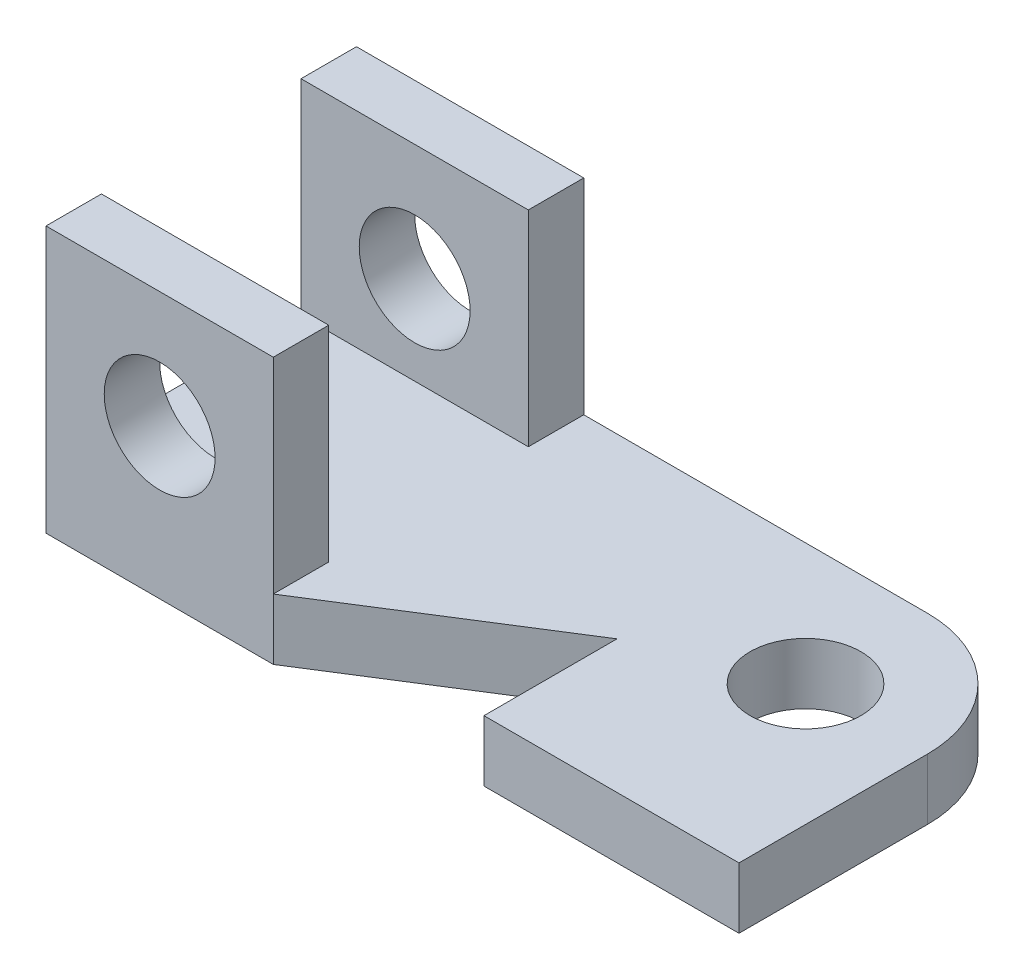
ISO-10303-21;
HEADER;
FILE_DESCRIPTION(('STEP AP214'),'2;1');
FILE_NAME('part.step','',(''),(''),'','','');
FILE_SCHEMA(('AUTOMOTIVE_DESIGN { 1 0 10303 214 1 1 1 1 }'));
ENDSEC;
DATA;
#1=APPLICATION_CONTEXT('core data for automotive mechanical design processes');
#2=APPLICATION_PROTOCOL_DEFINITION('international standard','automotive_design',2000,#1);
#3=PRODUCT_CONTEXT('',#1,'mechanical');
#4=PRODUCT('Part','Part','',(#3));
#5=PRODUCT_RELATED_PRODUCT_CATEGORY('part','',(#4));
#6=PRODUCT_DEFINITION_FORMATION('','',#4);
#7=PRODUCT_DEFINITION_CONTEXT('part definition',#1,'design');
#8=PRODUCT_DEFINITION('design','',#6,#7);
#9=PRODUCT_DEFINITION_SHAPE('','',#8);
#10=(LENGTH_UNIT() NAMED_UNIT(*) SI_UNIT(.MILLI.,.METRE.));
#11=(NAMED_UNIT(*) PLANE_ANGLE_UNIT() SI_UNIT($,.RADIAN.));
#12=(NAMED_UNIT(*) SI_UNIT($,.STERADIAN.) SOLID_ANGLE_UNIT());
#13=UNCERTAINTY_MEASURE_WITH_UNIT(LENGTH_MEASURE(1.E-05),#10,'distance_accuracy_value','');
#14=(GEOMETRIC_REPRESENTATION_CONTEXT(3) GLOBAL_UNCERTAINTY_ASSIGNED_CONTEXT((#13)) GLOBAL_UNIT_ASSIGNED_CONTEXT((#10,
#11,#12)) REPRESENTATION_CONTEXT('',''));
#15=CARTESIAN_POINT('',(0.,0.,0.));
#16=DIRECTION('',(0.,0.,1.));
#17=DIRECTION('',(1.,0.,0.));
#18=AXIS2_PLACEMENT_3D('',#15,#16,#17);
#19=CARTESIAN_POINT('',(-22.,11.,-34.));
#20=DIRECTION('',(0.,1.,0.));
#21=DIRECTION('',(0.,0.,1.));
#22=AXIS2_PLACEMENT_3D('',#19,#20,#21);
#23=PLANE('',#22);
#24=DIRECTION('',(0.,0.,-1.));
#25=VECTOR('',#24,1.);
#26=CARTESIAN_POINT('',(-84.,11.,-56.));
#27=LINE('',#26,#25);
#28=CARTESIAN_POINT('',(-84.,11.,-46.));
#29=VERTEX_POINT('',#28);
#30=CARTESIAN_POINT('',(-84.,11.,-56.));
#31=VERTEX_POINT('',#30);
#32=EDGE_CURVE('E155',#29,#31,#27,.T.);
#33=ORIENTED_EDGE('',*,*,#32,.F.);
#34=DIRECTION('',(1.,0.,0.));
#35=VECTOR('',#34,1.);
#36=CARTESIAN_POINT('',(-125.,11.,-46.));
#37=LINE('',#36,#35);
#38=CARTESIAN_POINT('',(-125.,11.,-46.));
#39=VERTEX_POINT('',#38);
#40=EDGE_CURVE('E60',#39,#29,#37,.T.);
#41=ORIENTED_EDGE('',*,*,#40,.F.);
#42=DIRECTION('',(0.,0.,1.));
#43=VECTOR('',#42,1.);
#44=CARTESIAN_POINT('',(-125.,11.,0.));
#45=LINE('',#44,#43);
#46=CARTESIAN_POINT('',(-125.,11.,-10.));
#47=VERTEX_POINT('',#46);
#48=EDGE_CURVE('E55',#39,#47,#45,.T.);
#49=ORIENTED_EDGE('',*,*,#48,.T.);
#50=DIRECTION('',(-1.,0.,0.));
#51=VECTOR('',#50,1.);
#52=CARTESIAN_POINT('',(-125.,11.,-10.));
#53=LINE('',#52,#51);
#54=CARTESIAN_POINT('',(-84.,11.,-10.));
#55=VERTEX_POINT('',#54);
#56=EDGE_CURVE('E178',#55,#47,#53,.T.);
#57=ORIENTED_EDGE('',*,*,#56,.F.);
#58=DIRECTION('',(0.,0.,-1.));
#59=VECTOR('',#58,1.);
#60=CARTESIAN_POINT('',(-84.,11.,0.));
#61=LINE('',#60,#59);
#62=CARTESIAN_POINT('',(-84.,11.,0.));
#63=VERTEX_POINT('',#62);
#64=EDGE_CURVE('E180',#63,#55,#61,.T.);
#65=ORIENTED_EDGE('',*,*,#64,.F.);
#66=DIRECTION('',(0.845488903030971,0.,-0.533992991387982));
#67=VECTOR('',#66,1.);
#68=CARTESIAN_POINT('',(-84.,11.,0.));
#69=LINE('',#68,#67);
#70=CARTESIAN_POINT('',(-46.,11.,-24.));
#71=VERTEX_POINT('',#70);
#72=EDGE_CURVE('E203',#63,#71,#69,.T.);
#73=ORIENTED_EDGE('',*,*,#72,.T.);
#74=DIRECTION('',(0.,0.,1.));
#75=VECTOR('',#74,1.);
#76=CARTESIAN_POINT('',(-46.,11.,0.));
#77=LINE('',#76,#75);
#78=CARTESIAN_POINT('',(-46.,11.,0.));
#79=VERTEX_POINT('',#78);
#80=EDGE_CURVE('E205',#71,#79,#77,.T.);
#81=ORIENTED_EDGE('',*,*,#80,.T.);
#82=DIRECTION('',(1.,0.,0.));
#83=VECTOR('',#82,1.);
#84=CARTESIAN_POINT('',(0.,11.,0.));
#85=LINE('',#84,#83);
#86=CARTESIAN_POINT('',(0.,11.,0.));
#87=VERTEX_POINT('',#86);
#88=EDGE_CURVE('E207',#79,#87,#85,.T.);
#89=ORIENTED_EDGE('',*,*,#88,.T.);
#90=DIRECTION('',(0.,0.,-1.));
#91=VECTOR('',#90,1.);
#92=CARTESIAN_POINT('',(0.,11.,0.));
#93=LINE('',#92,#91);
#94=CARTESIAN_POINT('',(0.,11.,-33.9999999999999));
#95=VERTEX_POINT('',#94);
#96=EDGE_CURVE('E194',#87,#95,#93,.T.);
#97=ORIENTED_EDGE('',*,*,#96,.T.);
#98=CARTESIAN_POINT('',(-22.,11.,-34.));
#99=DIRECTION('',(0.,1.,0.));
#100=DIRECTION('',(0.,0.,1.));
#101=AXIS2_PLACEMENT_3D('',#98,#99,#100);
#102=CIRCLE('',#101,22.);
#103=CARTESIAN_POINT('',(-22.0000000000002,11.,-56.));
#104=VERTEX_POINT('',#103);
#105=EDGE_CURVE('E197',#95,#104,#102,.T.);
#106=ORIENTED_EDGE('',*,*,#105,.T.);
#107=DIRECTION('',(-1.,0.,0.));
#108=VECTOR('',#107,1.);
#109=CARTESIAN_POINT('',(-22.0000000000002,11.,-56.));
#110=LINE('',#109,#108);
#111=EDGE_CURVE('E200',#104,#31,#110,.T.);
#112=ORIENTED_EDGE('',*,*,#111,.T.);
#113=EDGE_LOOP('',(#33,#41,#49,#57,#65,#73,#81,#89,#97,#106,#112));
#114=FACE_BOUND('',#113,.T.);
#115=CARTESIAN_POINT('',(-22.,11.,-34.));
#116=DIRECTION('',(0.,1.,0.));
#117=DIRECTION('',(0.,0.,1.));
#118=AXIS2_PLACEMENT_3D('',#115,#116,#117);
#119=CIRCLE('',#118,10.);
#120=CARTESIAN_POINT('',(-22.,11.,-24.));
#121=VERTEX_POINT('',#120);
#122=EDGE_CURVE('E162',#121,#121,#119,.T.);
#123=ORIENTED_EDGE('',*,*,#122,.F.);
#124=EDGE_LOOP('',(#123));
#125=FACE_BOUND('',#124,.T.);
#126=ADVANCED_FACE('F39',(#114,#125),#23,.T.);
#127=CARTESIAN_POINT('',(-22.,0.,-34.));
#128=DIRECTION('',(0.,1.,0.));
#129=DIRECTION('',(0.,0.,1.));
#130=AXIS2_PLACEMENT_3D('',#127,#128,#129);
#131=PLANE('',#130);
#132=DIRECTION('',(0.,0.,-1.));
#133=VECTOR('',#132,1.);
#134=CARTESIAN_POINT('',(0.,0.,0.));
#135=LINE('',#134,#133);
#136=CARTESIAN_POINT('',(0.,0.,0.));
#137=VERTEX_POINT('',#136);
#138=CARTESIAN_POINT('',(0.,0.,-33.9999999999999));
#139=VERTEX_POINT('',#138);
#140=EDGE_CURVE('E192',#137,#139,#135,.T.);
#141=ORIENTED_EDGE('',*,*,#140,.F.);
#142=DIRECTION('',(1.,0.,0.));
#143=VECTOR('',#142,1.);
#144=CARTESIAN_POINT('',(0.,0.,0.));
#145=LINE('',#144,#143);
#146=CARTESIAN_POINT('',(-46.,0.,0.));
#147=VERTEX_POINT('',#146);
#148=EDGE_CURVE('E198',#147,#137,#145,.T.);
#149=ORIENTED_EDGE('',*,*,#148,.F.);
#150=DIRECTION('',(0.,0.,1.));
#151=VECTOR('',#150,1.);
#152=CARTESIAN_POINT('',(-46.,0.,0.));
#153=LINE('',#152,#151);
#154=CARTESIAN_POINT('',(-46.,0.,-24.));
#155=VERTEX_POINT('',#154);
#156=EDGE_CURVE('E222',#155,#147,#153,.T.);
#157=ORIENTED_EDGE('',*,*,#156,.F.);
#158=DIRECTION('',(0.845488903030971,0.,-0.533992991387982));
#159=VECTOR('',#158,1.);
#160=CARTESIAN_POINT('',(-84.,0.,0.));
#161=LINE('',#160,#159);
#162=CARTESIAN_POINT('',(-84.,0.,0.));
#163=VERTEX_POINT('',#162);
#164=EDGE_CURVE('E220',#163,#155,#161,.T.);
#165=ORIENTED_EDGE('',*,*,#164,.F.);
#166=DIRECTION('',(1.,0.,0.));
#167=VECTOR('',#166,1.);
#168=CARTESIAN_POINT('',(-84.,0.,0.));
#169=LINE('',#168,#167);
#170=CARTESIAN_POINT('',(-125.,0.,0.));
#171=VERTEX_POINT('',#170);
#172=EDGE_CURVE('E218',#171,#163,#169,.T.);
#173=ORIENTED_EDGE('',*,*,#172,.F.);
#174=DIRECTION('',(0.,0.,1.));
#175=VECTOR('',#174,1.);
#176=CARTESIAN_POINT('',(-125.,0.,0.));
#177=LINE('',#176,#175);
#178=CARTESIAN_POINT('',(-125.,0.,-56.));
#179=VERTEX_POINT('',#178);
#180=EDGE_CURVE('E216',#179,#171,#177,.T.);
#181=ORIENTED_EDGE('',*,*,#180,.F.);
#182=DIRECTION('',(-1.,0.,0.));
#183=VECTOR('',#182,1.);
#184=CARTESIAN_POINT('',(-22.0000000000002,0.,-56.));
#185=LINE('',#184,#183);
#186=CARTESIAN_POINT('',(-22.0000000000002,0.,-56.));
#187=VERTEX_POINT('',#186);
#188=EDGE_CURVE('E214',#187,#179,#185,.T.);
#189=ORIENTED_EDGE('',*,*,#188,.F.);
#190=CARTESIAN_POINT('',(-22.,0.,-34.));
#191=DIRECTION('',(0.,1.,0.));
#192=DIRECTION('',(0.,0.,1.));
#193=AXIS2_PLACEMENT_3D('',#190,#191,#192);
#194=CIRCLE('',#193,22.);
#195=EDGE_CURVE('E212',#139,#187,#194,.T.);
#196=ORIENTED_EDGE('',*,*,#195,.F.);
#197=EDGE_LOOP('',(#141,#149,#157,#165,#173,#181,#189,#196));
#198=FACE_BOUND('',#197,.T.);
#199=CARTESIAN_POINT('',(-22.,0.,-34.));
#200=DIRECTION('',(0.,1.,0.));
#201=DIRECTION('',(0.,0.,1.));
#202=AXIS2_PLACEMENT_3D('',#199,#200,#201);
#203=CIRCLE('',#202,10.);
#204=CARTESIAN_POINT('',(-22.,0.,-24.));
#205=VERTEX_POINT('',#204);
#206=EDGE_CURVE('E159',#205,#205,#203,.T.);
#207=ORIENTED_EDGE('',*,*,#206,.T.);
#208=EDGE_LOOP('',(#207));
#209=FACE_BOUND('',#208,.T.);
#210=ADVANCED_FACE('F252',(#198,#209),#131,.F.);
#211=CARTESIAN_POINT('',(0.,11.,0.));
#212=DIRECTION('',(-1.,0.,0.));
#213=DIRECTION('',(0.,0.,1.));
#214=AXIS2_PLACEMENT_3D('',#211,#212,#213);
#215=PLANE('',#214);
#216=ORIENTED_EDGE('',*,*,#140,.T.);
#217=DIRECTION('',(0.,-1.,0.));
#218=VECTOR('',#217,1.);
#219=CARTESIAN_POINT('',(0.,11.,-33.9999999999999));
#220=LINE('',#219,#218);
#221=EDGE_CURVE('E11',#95,#139,#220,.T.);
#222=ORIENTED_EDGE('',*,*,#221,.F.);
#223=ORIENTED_EDGE('',*,*,#96,.F.);
#224=DIRECTION('',(0.,-1.,0.));
#225=VECTOR('',#224,1.);
#226=CARTESIAN_POINT('',(0.,11.,0.));
#227=LINE('',#226,#225);
#228=EDGE_CURVE('E209',#87,#137,#227,.T.);
#229=ORIENTED_EDGE('',*,*,#228,.T.);
#230=EDGE_LOOP('',(#216,#222,#223,#229));
#231=FACE_BOUND('',#230,.T.);
#232=ADVANCED_FACE('F41',(#231),#215,.F.);
#233=CARTESIAN_POINT('',(-22.,11.,-34.));
#234=DIRECTION('',(0.,-1.,0.));
#235=DIRECTION('',(0.,0.,-1.));
#236=AXIS2_PLACEMENT_3D('',#233,#234,#235);
#237=CYLINDRICAL_SURFACE('',#236,22.);
#238=ORIENTED_EDGE('',*,*,#195,.T.);
#239=DIRECTION('',(0.,-1.,0.));
#240=VECTOR('',#239,1.);
#241=CARTESIAN_POINT('',(-22.0000000000002,11.,-56.));
#242=LINE('',#241,#240);
#243=EDGE_CURVE('E48',#104,#187,#242,.T.);
#244=ORIENTED_EDGE('',*,*,#243,.F.);
#245=ORIENTED_EDGE('',*,*,#105,.F.);
#246=ORIENTED_EDGE('',*,*,#221,.T.);
#247=EDGE_LOOP('',(#238,#244,#245,#246));
#248=FACE_BOUND('',#247,.T.);
#249=ADVANCED_FACE('F312',(#248),#237,.T.);
#250=CARTESIAN_POINT('',(-22.0000000000002,11.,-56.));
#251=DIRECTION('',(0.,0.,1.));
#252=DIRECTION('',(1.,0.,0.));
#253=AXIS2_PLACEMENT_3D('',#250,#251,#252);
#254=PLANE('',#253);
#255=CARTESIAN_POINT('',(-104.5,27.,-56.));
#256=DIRECTION('',(0.,0.,1.));
#257=DIRECTION('',(1.,0.,0.));
#258=AXIS2_PLACEMENT_3D('',#255,#256,#257);
#259=CIRCLE('',#258,9.99999999999999);
#260=CARTESIAN_POINT('',(-94.5,27.,-56.));
#261=VERTEX_POINT('',#260);
#262=EDGE_CURVE('E343',#261,#261,#259,.T.);
#263=ORIENTED_EDGE('',*,*,#262,.T.);
#264=EDGE_LOOP('',(#263));
#265=FACE_BOUND('',#264,.T.);
#266=ORIENTED_EDGE('',*,*,#188,.T.);
#267=DIRECTION('',(0.,-1.,0.));
#268=VECTOR('',#267,1.);
#269=CARTESIAN_POINT('',(-125.,11.,-56.));
#270=LINE('',#269,#268);
#271=CARTESIAN_POINT('',(-125.,48.,-56.));
#272=VERTEX_POINT('',#271);
#273=EDGE_CURVE('E239',#272,#179,#270,.T.);
#274=ORIENTED_EDGE('',*,*,#273,.F.);
#275=DIRECTION('',(-1.,0.,0.));
#276=VECTOR('',#275,1.);
#277=CARTESIAN_POINT('',(-125.,48.,-56.));
#278=LINE('',#277,#276);
#279=CARTESIAN_POINT('',(-84.,48.,-56.));
#280=VERTEX_POINT('',#279);
#281=EDGE_CURVE('E152',#280,#272,#278,.T.);
#282=ORIENTED_EDGE('',*,*,#281,.F.);
#283=DIRECTION('',(0.,-1.,0.));
#284=VECTOR('',#283,1.);
#285=CARTESIAN_POINT('',(-84.,48.,-56.));
#286=LINE('',#285,#284);
#287=EDGE_CURVE('E164',#280,#31,#286,.T.);
#288=ORIENTED_EDGE('',*,*,#287,.T.);
#289=ORIENTED_EDGE('',*,*,#111,.F.);
#290=ORIENTED_EDGE('',*,*,#243,.T.);
#291=EDGE_LOOP('',(#266,#274,#282,#288,#289,#290));
#292=FACE_BOUND('',#291,.T.);
#293=ADVANCED_FACE('F246',(#265,#292),#254,.F.);
#294=CARTESIAN_POINT('',(-125.,11.,0.));
#295=DIRECTION('',(1.,0.,0.));
#296=DIRECTION('',(0.,0.,-1.));
#297=AXIS2_PLACEMENT_3D('',#294,#295,#296);
#298=PLANE('',#297);
#299=ORIENTED_EDGE('',*,*,#180,.T.);
#300=DIRECTION('',(0.,-1.,0.));
#301=VECTOR('',#300,1.);
#302=CARTESIAN_POINT('',(-125.,11.,0.));
#303=LINE('',#302,#301);
#304=CARTESIAN_POINT('',(-125.,48.,0.));
#305=VERTEX_POINT('',#304);
#306=EDGE_CURVE('E236',#305,#171,#303,.T.);
#307=ORIENTED_EDGE('',*,*,#306,.F.);
#308=DIRECTION('',(0.,0.,1.));
#309=VECTOR('',#308,1.);
#310=CARTESIAN_POINT('',(-125.,48.,0.));
#311=LINE('',#310,#309);
#312=CARTESIAN_POINT('',(-125.,48.,-10.));
#313=VERTEX_POINT('',#312);
#314=EDGE_CURVE('E181',#313,#305,#311,.T.);
#315=ORIENTED_EDGE('',*,*,#314,.F.);
#316=DIRECTION('',(0.,-1.,0.));
#317=VECTOR('',#316,1.);
#318=CARTESIAN_POINT('',(-125.,48.,-10.));
#319=LINE('',#318,#317);
#320=EDGE_CURVE('E175',#313,#47,#319,.T.);
#321=ORIENTED_EDGE('',*,*,#320,.T.);
#322=ORIENTED_EDGE('',*,*,#48,.F.);
#323=DIRECTION('',(0.,-1.,0.));
#324=VECTOR('',#323,1.);
#325=CARTESIAN_POINT('',(-125.,48.,-46.));
#326=LINE('',#325,#324);
#327=CARTESIAN_POINT('',(-125.,48.,-46.));
#328=VERTEX_POINT('',#327);
#329=EDGE_CURVE('E140',#328,#39,#326,.T.);
#330=ORIENTED_EDGE('',*,*,#329,.F.);
#331=DIRECTION('',(0.,0.,1.));
#332=VECTOR('',#331,1.);
#333=CARTESIAN_POINT('',(-125.,48.,-56.));
#334=LINE('',#333,#332);
#335=EDGE_CURVE('E146',#272,#328,#334,.T.);
#336=ORIENTED_EDGE('',*,*,#335,.F.);
#337=ORIENTED_EDGE('',*,*,#273,.T.);
#338=EDGE_LOOP('',(#299,#307,#315,#321,#322,#330,#336,#337));
#339=FACE_BOUND('',#338,.T.);
#340=ADVANCED_FACE('F157',(#339),#298,.F.);
#341=CARTESIAN_POINT('',(-84.,11.,0.));
#342=DIRECTION('',(0.,0.,-1.));
#343=DIRECTION('',(-1.,0.,0.));
#344=AXIS2_PLACEMENT_3D('',#341,#342,#343);
#345=PLANE('',#344);
#346=CARTESIAN_POINT('',(-104.5,27.,0.));
#347=DIRECTION('',(0.,0.,-1.));
#348=DIRECTION('',(-1.,0.,0.));
#349=AXIS2_PLACEMENT_3D('',#346,#347,#348);
#350=CIRCLE('',#349,9.99999999999999);
#351=CARTESIAN_POINT('',(-114.5,27.,0.));
#352=VERTEX_POINT('',#351);
#353=EDGE_CURVE('E172',#352,#352,#350,.T.);
#354=ORIENTED_EDGE('',*,*,#353,.T.);
#355=EDGE_LOOP('',(#354));
#356=FACE_BOUND('',#355,.T.);
#357=ORIENTED_EDGE('',*,*,#172,.T.);
#358=DIRECTION('',(0.,-1.,0.));
#359=VECTOR('',#358,1.);
#360=CARTESIAN_POINT('',(-84.,11.,0.));
#361=LINE('',#360,#359);
#362=EDGE_CURVE('E233',#63,#163,#361,.T.);
#363=ORIENTED_EDGE('',*,*,#362,.F.);
#364=DIRECTION('',(0.,-1.,0.));
#365=VECTOR('',#364,1.);
#366=CARTESIAN_POINT('',(-84.,48.,0.));
#367=LINE('',#366,#365);
#368=CARTESIAN_POINT('',(-84.,48.,0.));
#369=VERTEX_POINT('',#368);
#370=EDGE_CURVE('E168',#369,#63,#367,.T.);
#371=ORIENTED_EDGE('',*,*,#370,.F.);
#372=DIRECTION('',(1.,0.,0.));
#373=VECTOR('',#372,1.);
#374=CARTESIAN_POINT('',(-125.,48.,0.));
#375=LINE('',#374,#373);
#376=EDGE_CURVE('E187',#305,#369,#375,.T.);
#377=ORIENTED_EDGE('',*,*,#376,.F.);
#378=ORIENTED_EDGE('',*,*,#306,.T.);
#379=EDGE_LOOP('',(#357,#363,#371,#377,#378));
#380=FACE_BOUND('',#379,.T.);
#381=ADVANCED_FACE('F259',(#356,#380),#345,.F.);
#382=CARTESIAN_POINT('',(-84.,11.,0.));
#383=DIRECTION('',(-0.533992991387982,0.,-0.845488903030971));
#384=DIRECTION('',(-0.845488903030971,0.,0.533992991387982));
#385=AXIS2_PLACEMENT_3D('',#382,#383,#384);
#386=PLANE('',#385);
#387=ORIENTED_EDGE('',*,*,#164,.T.);
#388=DIRECTION('',(0.,-1.,0.));
#389=VECTOR('',#388,1.);
#390=CARTESIAN_POINT('',(-46.,11.,-24.));
#391=LINE('',#390,#389);
#392=EDGE_CURVE('E230',#71,#155,#391,.T.);
#393=ORIENTED_EDGE('',*,*,#392,.F.);
#394=ORIENTED_EDGE('',*,*,#72,.F.);
#395=ORIENTED_EDGE('',*,*,#362,.T.);
#396=EDGE_LOOP('',(#387,#393,#394,#395));
#397=FACE_BOUND('',#396,.T.);
#398=ADVANCED_FACE('F303',(#397),#386,.F.);
#399=CARTESIAN_POINT('',(-46.,11.,0.));
#400=DIRECTION('',(1.,0.,0.));
#401=DIRECTION('',(0.,0.,-1.));
#402=AXIS2_PLACEMENT_3D('',#399,#400,#401);
#403=PLANE('',#402);
#404=ORIENTED_EDGE('',*,*,#156,.T.);
#405=DIRECTION('',(0.,-1.,0.));
#406=VECTOR('',#405,1.);
#407=CARTESIAN_POINT('',(-46.,11.,0.));
#408=LINE('',#407,#406);
#409=EDGE_CURVE('E227',#79,#147,#408,.T.);
#410=ORIENTED_EDGE('',*,*,#409,.F.);
#411=ORIENTED_EDGE('',*,*,#80,.F.);
#412=ORIENTED_EDGE('',*,*,#392,.T.);
#413=EDGE_LOOP('',(#404,#410,#411,#412));
#414=FACE_BOUND('',#413,.T.);
#415=ADVANCED_FACE('F299',(#414),#403,.F.);
#416=CARTESIAN_POINT('',(0.,11.,0.));
#417=DIRECTION('',(0.,0.,-1.));
#418=DIRECTION('',(-1.,0.,0.));
#419=AXIS2_PLACEMENT_3D('',#416,#417,#418);
#420=PLANE('',#419);
#421=ORIENTED_EDGE('',*,*,#148,.T.);
#422=ORIENTED_EDGE('',*,*,#228,.F.);
#423=ORIENTED_EDGE('',*,*,#88,.F.);
#424=ORIENTED_EDGE('',*,*,#409,.T.);
#425=EDGE_LOOP('',(#421,#422,#423,#424));
#426=FACE_BOUND('',#425,.T.);
#427=ADVANCED_FACE('F284',(#426),#420,.F.);
#428=CARTESIAN_POINT('',(-22.,11.,-34.));
#429=DIRECTION('',(0.,-1.,0.));
#430=DIRECTION('',(0.,0.,-1.));
#431=AXIS2_PLACEMENT_3D('',#428,#429,#430);
#432=CYLINDRICAL_SURFACE('',#431,10.);
#433=ORIENTED_EDGE('',*,*,#122,.T.);
#434=EDGE_LOOP('',(#433));
#435=FACE_BOUND('',#434,.T.);
#436=ORIENTED_EDGE('',*,*,#206,.F.);
#437=EDGE_LOOP('',(#436));
#438=FACE_BOUND('',#437,.T.);
#439=ADVANCED_FACE('F274',(#435,#438),#432,.F.);
#440=CARTESIAN_POINT('',(-84.,48.,0.));
#441=DIRECTION('',(-1.,0.,0.));
#442=DIRECTION('',(0.,0.,1.));
#443=AXIS2_PLACEMENT_3D('',#440,#441,#442);
#444=PLANE('',#443);
#445=ORIENTED_EDGE('',*,*,#64,.T.);
#446=DIRECTION('',(0.,-1.,0.));
#447=VECTOR('',#446,1.);
#448=CARTESIAN_POINT('',(-84.,48.,-10.));
#449=LINE('',#448,#447);
#450=CARTESIAN_POINT('',(-84.,48.,-10.));
#451=VERTEX_POINT('',#450);
#452=EDGE_CURVE('E171',#451,#55,#449,.T.);
#453=ORIENTED_EDGE('',*,*,#452,.F.);
#454=DIRECTION('',(0.,0.,-1.));
#455=VECTOR('',#454,1.);
#456=CARTESIAN_POINT('',(-84.,48.,0.));
#457=LINE('',#456,#455);
#458=EDGE_CURVE('E185',#369,#451,#457,.T.);
#459=ORIENTED_EDGE('',*,*,#458,.F.);
#460=ORIENTED_EDGE('',*,*,#370,.T.);
#461=EDGE_LOOP('',(#445,#453,#459,#460));
#462=FACE_BOUND('',#461,.T.);
#463=ADVANCED_FACE('F272',(#462),#444,.F.);
#464=CARTESIAN_POINT('',(-125.,48.,-10.));
#465=DIRECTION('',(0.,0.,1.));
#466=DIRECTION('',(1.,0.,0.));
#467=AXIS2_PLACEMENT_3D('',#464,#465,#466);
#468=PLANE('',#467);
#469=CARTESIAN_POINT('',(-104.5,27.,-10.));
#470=DIRECTION('',(0.,0.,1.));
#471=DIRECTION('',(1.,0.,0.));
#472=AXIS2_PLACEMENT_3D('',#469,#470,#471);
#473=CIRCLE('',#472,9.99999999999999);
#474=CARTESIAN_POINT('',(-94.5,27.,-10.));
#475=VERTEX_POINT('',#474);
#476=EDGE_CURVE('E340',#475,#475,#473,.T.);
#477=ORIENTED_EDGE('',*,*,#476,.T.);
#478=EDGE_LOOP('',(#477));
#479=FACE_BOUND('',#478,.T.);
#480=ORIENTED_EDGE('',*,*,#56,.T.);
#481=ORIENTED_EDGE('',*,*,#320,.F.);
#482=DIRECTION('',(-1.,0.,0.));
#483=VECTOR('',#482,1.);
#484=CARTESIAN_POINT('',(-125.,48.,-10.));
#485=LINE('',#484,#483);
#486=EDGE_CURVE('E177',#451,#313,#485,.T.);
#487=ORIENTED_EDGE('',*,*,#486,.F.);
#488=ORIENTED_EDGE('',*,*,#452,.T.);
#489=EDGE_LOOP('',(#480,#481,#487,#488));
#490=FACE_BOUND('',#489,.T.);
#491=ADVANCED_FACE('F268',(#479,#490),#468,.F.);
#492=CARTESIAN_POINT('',(0.,48.,0.));
#493=DIRECTION('',(0.,-1.,0.));
#494=DIRECTION('',(0.,0.,-1.));
#495=AXIS2_PLACEMENT_3D('',#492,#493,#494);
#496=PLANE('',#495);
#497=ORIENTED_EDGE('',*,*,#314,.T.);
#498=ORIENTED_EDGE('',*,*,#376,.T.);
#499=ORIENTED_EDGE('',*,*,#458,.T.);
#500=ORIENTED_EDGE('',*,*,#486,.T.);
#501=EDGE_LOOP('',(#497,#498,#499,#500));
#502=FACE_BOUND('',#501,.T.);
#503=ADVANCED_FACE('F264',(#502),#496,.F.);
#504=CARTESIAN_POINT('',(-125.,48.,-46.));
#505=DIRECTION('',(0.,0.,-1.));
#506=DIRECTION('',(-1.,0.,0.));
#507=AXIS2_PLACEMENT_3D('',#504,#505,#506);
#508=PLANE('',#507);
#509=CARTESIAN_POINT('',(-104.5,27.,-46.));
#510=DIRECTION('',(0.,0.,-1.));
#511=DIRECTION('',(-1.,0.,0.));
#512=AXIS2_PLACEMENT_3D('',#509,#510,#511);
#513=CIRCLE('',#512,9.99999999999999);
#514=CARTESIAN_POINT('',(-114.5,27.,-46.));
#515=VERTEX_POINT('',#514);
#516=EDGE_CURVE('E43',#515,#515,#513,.T.);
#517=ORIENTED_EDGE('',*,*,#516,.T.);
#518=EDGE_LOOP('',(#517));
#519=FACE_BOUND('',#518,.T.);
#520=ORIENTED_EDGE('',*,*,#40,.T.);
#521=DIRECTION('',(0.,-1.,0.));
#522=VECTOR('',#521,1.);
#523=CARTESIAN_POINT('',(-84.,48.,-46.));
#524=LINE('',#523,#522);
#525=CARTESIAN_POINT('',(-84.,48.,-46.));
#526=VERTEX_POINT('',#525);
#527=EDGE_CURVE('E142',#526,#29,#524,.T.);
#528=ORIENTED_EDGE('',*,*,#527,.F.);
#529=DIRECTION('',(1.,0.,0.));
#530=VECTOR('',#529,1.);
#531=CARTESIAN_POINT('',(-125.,48.,-46.));
#532=LINE('',#531,#530);
#533=EDGE_CURVE('E136',#328,#526,#532,.T.);
#534=ORIENTED_EDGE('',*,*,#533,.F.);
#535=ORIENTED_EDGE('',*,*,#329,.T.);
#536=EDGE_LOOP('',(#520,#528,#534,#535));
#537=FACE_BOUND('',#536,.T.);
#538=ADVANCED_FACE('F138',(#519,#537),#508,.F.);
#539=CARTESIAN_POINT('',(-84.,48.,-56.));
#540=DIRECTION('',(-1.,0.,0.));
#541=DIRECTION('',(0.,0.,1.));
#542=AXIS2_PLACEMENT_3D('',#539,#540,#541);
#543=PLANE('',#542);
#544=ORIENTED_EDGE('',*,*,#32,.T.);
#545=ORIENTED_EDGE('',*,*,#287,.F.);
#546=DIRECTION('',(0.,0.,-1.));
#547=VECTOR('',#546,1.);
#548=CARTESIAN_POINT('',(-84.,48.,-56.));
#549=LINE('',#548,#547);
#550=EDGE_CURVE('E145',#526,#280,#549,.T.);
#551=ORIENTED_EDGE('',*,*,#550,.F.);
#552=ORIENTED_EDGE('',*,*,#527,.T.);
#553=EDGE_LOOP('',(#544,#545,#551,#552));
#554=FACE_BOUND('',#553,.T.);
#555=ADVANCED_FACE('F332',(#554),#543,.F.);
#556=CARTESIAN_POINT('',(0.,48.,0.));
#557=DIRECTION('',(0.,1.,0.));
#558=DIRECTION('',(0.,0.,1.));
#559=AXIS2_PLACEMENT_3D('',#556,#557,#558);
#560=PLANE('',#559);
#561=ORIENTED_EDGE('',*,*,#335,.T.);
#562=ORIENTED_EDGE('',*,*,#533,.T.);
#563=ORIENTED_EDGE('',*,*,#550,.T.);
#564=ORIENTED_EDGE('',*,*,#281,.T.);
#565=EDGE_LOOP('',(#561,#562,#563,#564));
#566=FACE_BOUND('',#565,.T.);
#567=ADVANCED_FACE('F150',(#566),#560,.T.);
#568=CARTESIAN_POINT('',(-104.5,27.,-56.));
#569=DIRECTION('',(0.,0.,1.));
#570=DIRECTION('',(1.,0.,0.));
#571=AXIS2_PLACEMENT_3D('',#568,#569,#570);
#572=CYLINDRICAL_SURFACE('',#571,9.99999999999999);
#573=ORIENTED_EDGE('',*,*,#262,.F.);
#574=EDGE_LOOP('',(#573));
#575=FACE_BOUND('',#574,.T.);
#576=ORIENTED_EDGE('',*,*,#516,.F.);
#577=EDGE_LOOP('',(#576));
#578=FACE_BOUND('',#577,.T.);
#579=ADVANCED_FACE('F350',(#575,#578),#572,.F.);
#580=ORIENTED_EDGE('',*,*,#476,.F.);
#581=EDGE_LOOP('',(#580));
#582=FACE_BOUND('',#581,.T.);
#583=ORIENTED_EDGE('',*,*,#353,.F.);
#584=EDGE_LOOP('',(#583));
#585=FACE_BOUND('',#584,.T.);
#586=ADVANCED_FACE('F352',(#582,#585),#572,.F.);
#587=CLOSED_SHELL('',(#126,#210,#232,#249,#293,#340,#381,#398,#415,#427,#439,#463,#491,#503,
#538,#555,#567,#579,#586));
#588=MANIFOLD_SOLID_BREP('B2',#587);
#589=ADVANCED_BREP_SHAPE_REPRESENTATION('',(#18,#588),#14);
#590=SHAPE_DEFINITION_REPRESENTATION(#9,#589);
ENDSEC;
END-ISO-10303-21;
